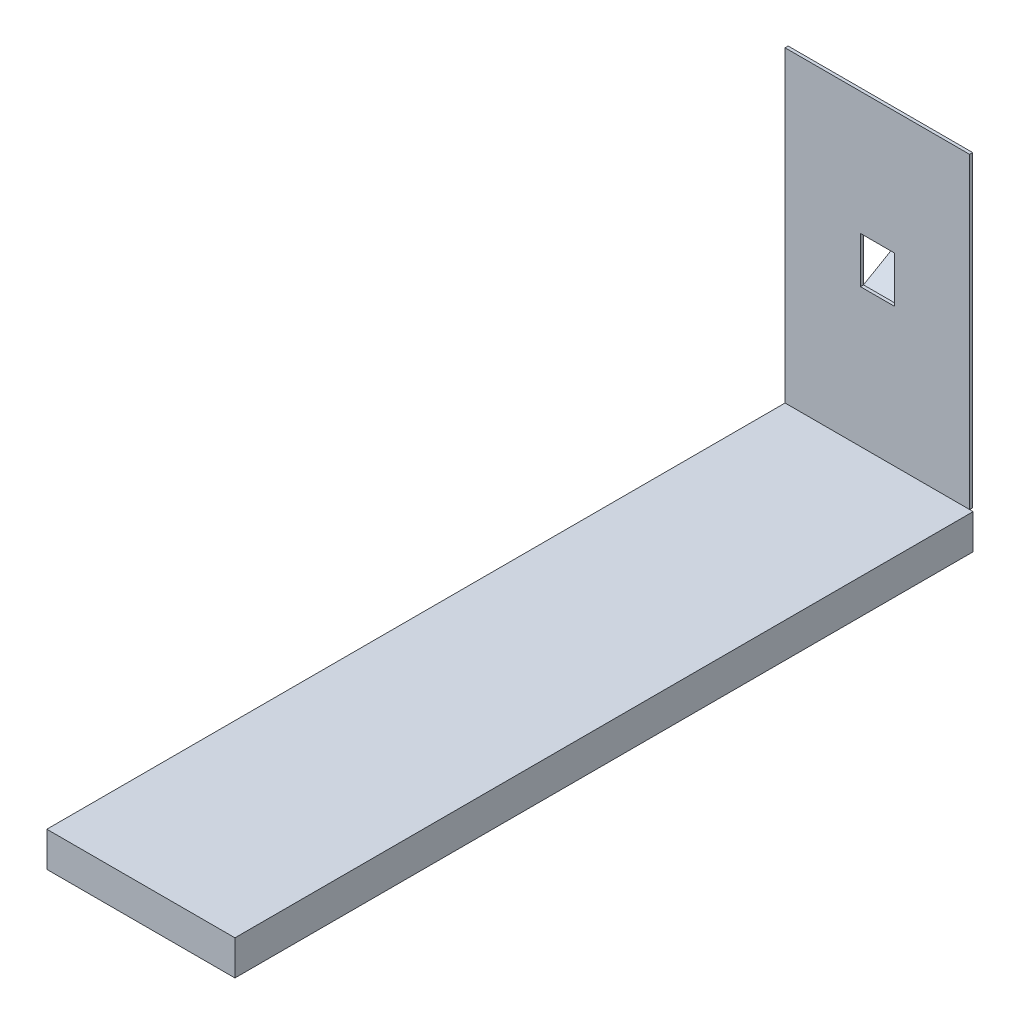
ISO-10303-21;
HEADER;
FILE_DESCRIPTION(('STEP AP214'),'2;1');
FILE_NAME('part.step','',(''),(''),'','','');
FILE_SCHEMA(('AUTOMOTIVE_DESIGN { 1 0 10303 214 1 1 1 1 }'));
ENDSEC;
DATA;
#1=APPLICATION_CONTEXT('core data for automotive mechanical design processes');
#2=APPLICATION_PROTOCOL_DEFINITION('international standard','automotive_design',2000,#1);
#3=PRODUCT_CONTEXT('',#1,'mechanical');
#4=PRODUCT('Part','Part','',(#3));
#5=PRODUCT_RELATED_PRODUCT_CATEGORY('part','',(#4));
#6=PRODUCT_DEFINITION_FORMATION('','',#4);
#7=PRODUCT_DEFINITION_CONTEXT('part definition',#1,'design');
#8=PRODUCT_DEFINITION('design','',#6,#7);
#9=PRODUCT_DEFINITION_SHAPE('','',#8);
#10=(LENGTH_UNIT() NAMED_UNIT(*) SI_UNIT(.MILLI.,.METRE.));
#11=(NAMED_UNIT(*) PLANE_ANGLE_UNIT() SI_UNIT($,.RADIAN.));
#12=(NAMED_UNIT(*) SI_UNIT($,.STERADIAN.) SOLID_ANGLE_UNIT());
#13=UNCERTAINTY_MEASURE_WITH_UNIT(LENGTH_MEASURE(1.E-05),#10,'distance_accuracy_value','');
#14=(GEOMETRIC_REPRESENTATION_CONTEXT(3) GLOBAL_UNCERTAINTY_ASSIGNED_CONTEXT((#13)) GLOBAL_UNIT_ASSIGNED_CONTEXT((#10,
#11,#12)) REPRESENTATION_CONTEXT('',''));
#15=CARTESIAN_POINT('',(0.,0.,0.));
#16=DIRECTION('',(0.,0.,1.));
#17=DIRECTION('',(1.,0.,0.));
#18=AXIS2_PLACEMENT_3D('',#15,#16,#17);
#19=CARTESIAN_POINT('',(-600.,-1000.,4819.57152918214));
#20=DIRECTION('',(1.,0.,0.));
#21=DIRECTION('',(0.,0.,-1.));
#22=AXIS2_PLACEMENT_3D('',#19,#20,#21);
#23=PLANE('',#22);
#24=DIRECTION('',(0.,-1.,0.));
#25=VECTOR('',#24,1.);
#26=CARTESIAN_POINT('',(-600.,-1000.,20.));
#27=LINE('',#26,#25);
#28=CARTESIAN_POINT('',(-600.,-1000.,20.));
#29=VERTEX_POINT('',#28);
#30=CARTESIAN_POINT('',(-600.,-1226.24036004448,20.));
#31=VERTEX_POINT('',#30);
#32=EDGE_CURVE('E108',#29,#31,#27,.T.);
#33=ORIENTED_EDGE('',*,*,#32,.T.);
#34=DIRECTION('',(0.,0.,-1.));
#35=VECTOR('',#34,1.);
#36=CARTESIAN_POINT('',(-600.,-1226.24036004448,4819.57152918214));
#37=LINE('',#36,#35);
#38=CARTESIAN_POINT('',(-600.,-1226.24036004448,4819.57152918214));
#39=VERTEX_POINT('',#38);
#40=EDGE_CURVE('E12',#39,#31,#37,.T.);
#41=ORIENTED_EDGE('',*,*,#40,.F.);
#42=DIRECTION('',(0.,-1.,0.));
#43=VECTOR('',#42,1.);
#44=CARTESIAN_POINT('',(-600.,-1000.,4819.57152918214));
#45=LINE('',#44,#43);
#46=CARTESIAN_POINT('',(-600.,-1000.,4819.57152918214));
#47=VERTEX_POINT('',#46);
#48=EDGE_CURVE('E96',#47,#39,#45,.T.);
#49=ORIENTED_EDGE('',*,*,#48,.F.);
#50=DIRECTION('',(0.,0.,-1.));
#51=VECTOR('',#50,1.);
#52=CARTESIAN_POINT('',(-600.,-1000.,4819.57152918214));
#53=LINE('',#52,#51);
#54=EDGE_CURVE('E104',#47,#29,#53,.T.);
#55=ORIENTED_EDGE('',*,*,#54,.T.);
#56=EDGE_LOOP('',(#33,#41,#49,#55));
#57=FACE_BOUND('',#56,.T.);
#58=ADVANCED_FACE('F45',(#57),#23,.F.);
#59=CARTESIAN_POINT('',(-600.,-1226.24036004448,4819.57152918214));
#60=DIRECTION('',(0.,1.,0.));
#61=DIRECTION('',(0.,0.,1.));
#62=AXIS2_PLACEMENT_3D('',#59,#60,#61);
#63=PLANE('',#62);
#64=DIRECTION('',(1.,0.,0.));
#65=VECTOR('',#64,1.);
#66=CARTESIAN_POINT('',(-600.,-1226.24036004448,20.));
#67=LINE('',#66,#65);
#68=CARTESIAN_POINT('',(623.007667220371,-1226.24036004448,20.));
#69=VERTEX_POINT('',#68);
#70=EDGE_CURVE('E100',#31,#69,#67,.T.);
#71=ORIENTED_EDGE('',*,*,#70,.T.);
#72=DIRECTION('',(0.,0.,-1.));
#73=VECTOR('',#72,1.);
#74=CARTESIAN_POINT('',(623.007667220371,-1226.24036004448,4819.57152918214));
#75=LINE('',#74,#73);
#76=CARTESIAN_POINT('',(623.007667220371,-1226.24036004448,4819.57152918214));
#77=VERTEX_POINT('',#76);
#78=EDGE_CURVE('E53',#77,#69,#75,.T.);
#79=ORIENTED_EDGE('',*,*,#78,.F.);
#80=DIRECTION('',(1.,0.,0.));
#81=VECTOR('',#80,1.);
#82=CARTESIAN_POINT('',(-600.,-1226.24036004448,4819.57152918214));
#83=LINE('',#82,#81);
#84=EDGE_CURVE('E91',#39,#77,#83,.T.);
#85=ORIENTED_EDGE('',*,*,#84,.F.);
#86=ORIENTED_EDGE('',*,*,#40,.T.);
#87=EDGE_LOOP('',(#71,#79,#85,#86));
#88=FACE_BOUND('',#87,.T.);
#89=ADVANCED_FACE('F99',(#88),#63,.F.);
#90=CARTESIAN_POINT('',(623.007667220371,-1000.,4819.57152918214));
#91=DIRECTION('',(-1.,0.,0.));
#92=DIRECTION('',(0.,0.,1.));
#93=AXIS2_PLACEMENT_3D('',#90,#91,#92);
#94=PLANE('',#93);
#95=DIRECTION('',(0.,1.,0.));
#96=VECTOR('',#95,1.);
#97=CARTESIAN_POINT('',(623.007667220371,-1000.,20.));
#98=LINE('',#97,#96);
#99=CARTESIAN_POINT('',(623.007667220371,-1000.,20.));
#100=VERTEX_POINT('',#99);
#101=EDGE_CURVE('E78',#69,#100,#98,.T.);
#102=ORIENTED_EDGE('',*,*,#101,.T.);
#103=DIRECTION('',(0.,0.,-1.));
#104=VECTOR('',#103,1.);
#105=CARTESIAN_POINT('',(623.007667220371,-1000.,4819.57152918214));
#106=LINE('',#105,#104);
#107=CARTESIAN_POINT('',(623.007667220371,-1000.,4819.57152918214));
#108=VERTEX_POINT('',#107);
#109=EDGE_CURVE('E101',#108,#100,#106,.T.);
#110=ORIENTED_EDGE('',*,*,#109,.F.);
#111=DIRECTION('',(0.,1.,0.));
#112=VECTOR('',#111,1.);
#113=CARTESIAN_POINT('',(623.007667220371,-1000.,4819.57152918214));
#114=LINE('',#113,#112);
#115=EDGE_CURVE('E94',#77,#108,#114,.T.);
#116=ORIENTED_EDGE('',*,*,#115,.F.);
#117=ORIENTED_EDGE('',*,*,#78,.T.);
#118=EDGE_LOOP('',(#102,#110,#116,#117));
#119=FACE_BOUND('',#118,.T.);
#120=ADVANCED_FACE('F102',(#119),#94,.F.);
#121=CARTESIAN_POINT('',(-600.,-1000.,4819.57152918214));
#122=DIRECTION('',(0.,-1.,0.));
#123=DIRECTION('',(0.,0.,-1.));
#124=AXIS2_PLACEMENT_3D('',#121,#122,#123);
#125=PLANE('',#124);
#126=DIRECTION('',(-1.,0.,0.));
#127=VECTOR('',#126,1.);
#128=CARTESIAN_POINT('',(-600.,-1000.,20.));
#129=LINE('',#128,#127);
#130=EDGE_CURVE('E84',#100,#29,#129,.T.);
#131=ORIENTED_EDGE('',*,*,#130,.T.);
#132=ORIENTED_EDGE('',*,*,#54,.F.);
#133=DIRECTION('',(-1.,0.,0.));
#134=VECTOR('',#133,1.);
#135=CARTESIAN_POINT('',(-600.,-1000.,4819.57152918214));
#136=LINE('',#135,#134);
#137=EDGE_CURVE('E61',#108,#47,#136,.T.);
#138=ORIENTED_EDGE('',*,*,#137,.F.);
#139=ORIENTED_EDGE('',*,*,#109,.T.);
#140=EDGE_LOOP('',(#131,#132,#138,#139));
#141=FACE_BOUND('',#140,.T.);
#142=ADVANCED_FACE('F115',(#141),#125,.F.);
#143=CARTESIAN_POINT('',(0.,0.,4819.57152918214));
#144=DIRECTION('',(0.,0.,1.));
#145=DIRECTION('',(1.,0.,0.));
#146=AXIS2_PLACEMENT_3D('',#143,#144,#145);
#147=PLANE('',#146);
#148=ORIENTED_EDGE('',*,*,#48,.T.);
#149=ORIENTED_EDGE('',*,*,#84,.T.);
#150=ORIENTED_EDGE('',*,*,#115,.T.);
#151=ORIENTED_EDGE('',*,*,#137,.T.);
#152=EDGE_LOOP('',(#148,#149,#150,#151));
#153=FACE_BOUND('',#152,.T.);
#154=ADVANCED_FACE('F92',(#153),#147,.T.);
#155=CARTESIAN_POINT('',(0.,0.,20.));
#156=DIRECTION('',(0.,0.,1.));
#157=DIRECTION('',(1.,0.,0.));
#158=AXIS2_PLACEMENT_3D('',#155,#156,#157);
#159=PLANE('',#158);
#160=ORIENTED_EDGE('',*,*,#32,.F.);
#161=ORIENTED_EDGE('',*,*,#130,.F.);
#162=ORIENTED_EDGE('',*,*,#101,.F.);
#163=ORIENTED_EDGE('',*,*,#70,.F.);
#164=EDGE_LOOP('',(#160,#161,#162,#163));
#165=FACE_BOUND('',#164,.T.);
#166=ADVANCED_FACE('F118',(#165),#159,.F.);
#167=CLOSED_SHELL('',(#58,#89,#120,#142,#154,#166));
#168=MANIFOLD_SOLID_BREP('B2',#167);
#169=CARTESIAN_POINT('',(0.,0.,0.));
#170=DIRECTION('',(0.,0.,1.));
#171=DIRECTION('',(1.,0.,0.));
#172=AXIS2_PLACEMENT_3D('',#169,#170,#171);
#173=PLANE('',#172);
#174=DIRECTION('',(0.,-1.,0.));
#175=VECTOR('',#174,1.);
#176=CARTESIAN_POINT('',(-600.,-1000.,0.));
#177=LINE('',#176,#175);
#178=CARTESIAN_POINT('',(-600.,1000.,0.));
#179=VERTEX_POINT('',#178);
#180=CARTESIAN_POINT('',(-600.,-1000.,0.));
#181=VERTEX_POINT('',#180);
#182=EDGE_CURVE('E306',#179,#181,#177,.T.);
#183=ORIENTED_EDGE('',*,*,#182,.F.);
#184=DIRECTION('',(-1.,0.,0.));
#185=VECTOR('',#184,1.);
#186=CARTESIAN_POINT('',(600.,1000.,0.));
#187=LINE('',#186,#185);
#188=CARTESIAN_POINT('',(600.,1000.,0.));
#189=VERTEX_POINT('',#188);
#190=EDGE_CURVE('E316',#189,#179,#187,.T.);
#191=ORIENTED_EDGE('',*,*,#190,.F.);
#192=DIRECTION('',(0.,1.,0.));
#193=VECTOR('',#192,1.);
#194=CARTESIAN_POINT('',(600.,-1000.,0.));
#195=LINE('',#194,#193);
#196=CARTESIAN_POINT('',(600.,-1000.,0.));
#197=VERTEX_POINT('',#196);
#198=EDGE_CURVE('E327',#197,#189,#195,.T.);
#199=ORIENTED_EDGE('',*,*,#198,.F.);
#200=DIRECTION('',(1.,0.,0.));
#201=VECTOR('',#200,1.);
#202=CARTESIAN_POINT('',(600.,-1000.,0.));
#203=LINE('',#202,#201);
#204=EDGE_CURVE('E325',#181,#197,#203,.T.);
#205=ORIENTED_EDGE('',*,*,#204,.F.);
#206=EDGE_LOOP('',(#183,#191,#199,#205));
#207=FACE_BOUND('',#206,.T.);
#208=DIRECTION('',(0.,1.,0.));
#209=VECTOR('',#208,1.);
#210=CARTESIAN_POINT('',(-110.,-111.547005383792,0.));
#211=LINE('',#210,#209);
#212=CARTESIAN_POINT('',(-110.,-111.547005383792,0.));
#213=VERTEX_POINT('',#212);
#214=CARTESIAN_POINT('',(-110.,-99.9999999999996,0.));
#215=VERTEX_POINT('',#214);
#216=EDGE_CURVE('E277',#213,#215,#211,.T.);
#217=ORIENTED_EDGE('',*,*,#216,.F.);
#218=DIRECTION('',(-1.,0.,0.));
#219=VECTOR('',#218,1.);
#220=CARTESIAN_POINT('',(110.,-111.547005383792,0.));
#221=LINE('',#220,#219);
#222=CARTESIAN_POINT('',(110.,-111.547005383792,0.));
#223=VERTEX_POINT('',#222);
#224=EDGE_CURVE('E270',#223,#213,#221,.T.);
#225=ORIENTED_EDGE('',*,*,#224,.F.);
#226=DIRECTION('',(0.,1.,0.));
#227=VECTOR('',#226,1.);
#228=CARTESIAN_POINT('',(110.,-111.547005383792,0.));
#229=LINE('',#228,#227);
#230=CARTESIAN_POINT('',(110.,-99.9999999999996,0.));
#231=VERTEX_POINT('',#230);
#232=EDGE_CURVE('E252',#223,#231,#229,.T.);
#233=ORIENTED_EDGE('',*,*,#232,.T.);
#234=DIRECTION('',(0.,1.,0.));
#235=VECTOR('',#234,1.);
#236=CARTESIAN_POINT('',(110.,-99.9999999999996,0.));
#237=LINE('',#236,#235);
#238=CARTESIAN_POINT('',(110.,200.,0.));
#239=VERTEX_POINT('',#238);
#240=EDGE_CURVE('E285',#231,#239,#237,.T.);
#241=ORIENTED_EDGE('',*,*,#240,.T.);
#242=DIRECTION('',(-1.,0.,0.));
#243=VECTOR('',#242,1.);
#244=CARTESIAN_POINT('',(-110.,200.,0.));
#245=LINE('',#244,#243);
#246=CARTESIAN_POINT('',(-110.,200.,0.));
#247=VERTEX_POINT('',#246);
#248=EDGE_CURVE('E287',#239,#247,#245,.T.);
#249=ORIENTED_EDGE('',*,*,#248,.T.);
#250=DIRECTION('',(0.,-1.,0.));
#251=VECTOR('',#250,1.);
#252=CARTESIAN_POINT('',(-110.,-99.9999999999996,0.));
#253=LINE('',#252,#251);
#254=EDGE_CURVE('E192',#247,#215,#253,.T.);
#255=ORIENTED_EDGE('',*,*,#254,.T.);
#256=EDGE_LOOP('',(#217,#225,#233,#241,#249,#255));
#257=FACE_BOUND('',#256,.T.);
#258=ADVANCED_FACE('F169',(#207,#257),#173,.F.);
#259=CARTESIAN_POINT('',(-600.,-1000.,20.));
#260=DIRECTION('',(1.,0.,0.));
#261=DIRECTION('',(0.,0.,-1.));
#262=AXIS2_PLACEMENT_3D('',#259,#260,#261);
#263=PLANE('',#262);
#264=ORIENTED_EDGE('',*,*,#182,.T.);
#265=DIRECTION('',(0.,0.,-1.));
#266=VECTOR('',#265,1.);
#267=CARTESIAN_POINT('',(-600.,-1000.,20.));
#268=LINE('',#267,#266);
#269=CARTESIAN_POINT('',(-600.,-1000.,20.));
#270=VERTEX_POINT('',#269);
#271=EDGE_CURVE('E43',#270,#181,#268,.T.);
#272=ORIENTED_EDGE('',*,*,#271,.F.);
#273=DIRECTION('',(0.,-1.,0.));
#274=VECTOR('',#273,1.);
#275=CARTESIAN_POINT('',(-600.,-1000.,20.));
#276=LINE('',#275,#274);
#277=CARTESIAN_POINT('',(-600.,1000.,20.));
#278=VERTEX_POINT('',#277);
#279=EDGE_CURVE('E312',#278,#270,#276,.T.);
#280=ORIENTED_EDGE('',*,*,#279,.F.);
#281=DIRECTION('',(0.,0.,-1.));
#282=VECTOR('',#281,1.);
#283=CARTESIAN_POINT('',(-600.,1000.,20.));
#284=LINE('',#283,#282);
#285=EDGE_CURVE('E322',#278,#179,#284,.T.);
#286=ORIENTED_EDGE('',*,*,#285,.T.);
#287=EDGE_LOOP('',(#264,#272,#280,#286));
#288=FACE_BOUND('',#287,.T.);
#289=ADVANCED_FACE('F171',(#288),#263,.F.);
#290=CARTESIAN_POINT('',(600.,-1000.,20.));
#291=DIRECTION('',(0.,1.,0.));
#292=DIRECTION('',(-1.,0.,0.));
#293=AXIS2_PLACEMENT_3D('',#290,#291,#292);
#294=PLANE('',#293);
#295=ORIENTED_EDGE('',*,*,#204,.T.);
#296=DIRECTION('',(0.,0.,-1.));
#297=VECTOR('',#296,1.);
#298=CARTESIAN_POINT('',(600.,-1000.,20.));
#299=LINE('',#298,#297);
#300=CARTESIAN_POINT('',(600.,-1000.,20.));
#301=VERTEX_POINT('',#300);
#302=EDGE_CURVE('E177',#301,#197,#299,.T.);
#303=ORIENTED_EDGE('',*,*,#302,.F.);
#304=DIRECTION('',(1.,0.,0.));
#305=VECTOR('',#304,1.);
#306=CARTESIAN_POINT('',(600.,-1000.,20.));
#307=LINE('',#306,#305);
#308=EDGE_CURVE('E315',#270,#301,#307,.T.);
#309=ORIENTED_EDGE('',*,*,#308,.F.);
#310=ORIENTED_EDGE('',*,*,#271,.T.);
#311=EDGE_LOOP('',(#295,#303,#309,#310));
#312=FACE_BOUND('',#311,.T.);
#313=ADVANCED_FACE('F354',(#312),#294,.F.);
#314=CARTESIAN_POINT('',(600.,-1000.,20.));
#315=DIRECTION('',(-1.,0.,0.));
#316=DIRECTION('',(0.,0.,1.));
#317=AXIS2_PLACEMENT_3D('',#314,#315,#316);
#318=PLANE('',#317);
#319=ORIENTED_EDGE('',*,*,#198,.T.);
#320=DIRECTION('',(0.,0.,-1.));
#321=VECTOR('',#320,1.);
#322=CARTESIAN_POINT('',(600.,1000.,20.));
#323=LINE('',#322,#321);
#324=CARTESIAN_POINT('',(600.,1000.,20.));
#325=VERTEX_POINT('',#324);
#326=EDGE_CURVE('E332',#325,#189,#323,.T.);
#327=ORIENTED_EDGE('',*,*,#326,.F.);
#328=DIRECTION('',(0.,1.,0.));
#329=VECTOR('',#328,1.);
#330=CARTESIAN_POINT('',(600.,-1000.,20.));
#331=LINE('',#330,#329);
#332=EDGE_CURVE('E318',#301,#325,#331,.T.);
#333=ORIENTED_EDGE('',*,*,#332,.F.);
#334=ORIENTED_EDGE('',*,*,#302,.T.);
#335=EDGE_LOOP('',(#319,#327,#333,#334));
#336=FACE_BOUND('',#335,.T.);
#337=ADVANCED_FACE('F339',(#336),#318,.F.);
#338=CARTESIAN_POINT('',(600.,1000.,20.));
#339=DIRECTION('',(0.,-1.,0.));
#340=DIRECTION('',(0.,0.,-1.));
#341=AXIS2_PLACEMENT_3D('',#338,#339,#340);
#342=PLANE('',#341);
#343=ORIENTED_EDGE('',*,*,#190,.T.);
#344=ORIENTED_EDGE('',*,*,#285,.F.);
#345=DIRECTION('',(-1.,0.,0.));
#346=VECTOR('',#345,1.);
#347=CARTESIAN_POINT('',(600.,1000.,20.));
#348=LINE('',#347,#346);
#349=EDGE_CURVE('E320',#325,#278,#348,.T.);
#350=ORIENTED_EDGE('',*,*,#349,.F.);
#351=ORIENTED_EDGE('',*,*,#326,.T.);
#352=EDGE_LOOP('',(#343,#344,#350,#351));
#353=FACE_BOUND('',#352,.T.);
#354=ADVANCED_FACE('F347',(#353),#342,.F.);
#355=CARTESIAN_POINT('',(0.,0.,20.));
#356=DIRECTION('',(0.,0.,1.));
#357=DIRECTION('',(1.,0.,0.));
#358=AXIS2_PLACEMENT_3D('',#355,#356,#357);
#359=PLANE('',#358);
#360=DIRECTION('',(0.,1.,0.));
#361=VECTOR('',#360,1.);
#362=CARTESIAN_POINT('',(110.,-99.9999999999996,20.));
#363=LINE('',#362,#361);
#364=CARTESIAN_POINT('',(110.,-99.9999999999996,20.));
#365=VERTEX_POINT('',#364);
#366=CARTESIAN_POINT('',(110.,200.,20.));
#367=VERTEX_POINT('',#366);
#368=EDGE_CURVE('E184',#365,#367,#363,.T.);
#369=ORIENTED_EDGE('',*,*,#368,.F.);
#370=DIRECTION('',(1.,0.,0.));
#371=VECTOR('',#370,1.);
#372=CARTESIAN_POINT('',(-110.,-99.9999999999996,20.));
#373=LINE('',#372,#371);
#374=CARTESIAN_POINT('',(-110.,-99.9999999999996,20.));
#375=VERTEX_POINT('',#374);
#376=EDGE_CURVE('E288',#375,#365,#373,.T.);
#377=ORIENTED_EDGE('',*,*,#376,.F.);
#378=DIRECTION('',(0.,-1.,0.));
#379=VECTOR('',#378,1.);
#380=CARTESIAN_POINT('',(-110.,-99.9999999999996,20.));
#381=LINE('',#380,#379);
#382=CARTESIAN_POINT('',(-110.,200.,20.));
#383=VERTEX_POINT('',#382);
#384=EDGE_CURVE('E299',#383,#375,#381,.T.);
#385=ORIENTED_EDGE('',*,*,#384,.F.);
#386=DIRECTION('',(-1.,0.,0.));
#387=VECTOR('',#386,1.);
#388=CARTESIAN_POINT('',(-110.,200.,20.));
#389=LINE('',#388,#387);
#390=EDGE_CURVE('E296',#367,#383,#389,.T.);
#391=ORIENTED_EDGE('',*,*,#390,.F.);
#392=EDGE_LOOP('',(#369,#377,#385,#391));
#393=FACE_BOUND('',#392,.T.);
#394=ORIENTED_EDGE('',*,*,#279,.T.);
#395=ORIENTED_EDGE('',*,*,#308,.T.);
#396=ORIENTED_EDGE('',*,*,#332,.T.);
#397=ORIENTED_EDGE('',*,*,#349,.T.);
#398=EDGE_LOOP('',(#394,#395,#396,#397));
#399=FACE_BOUND('',#398,.T.);
#400=ADVANCED_FACE('F353',(#393,#399),#359,.T.);
#401=CARTESIAN_POINT('',(110.,-99.9999999999996,0.));
#402=DIRECTION('',(1.,0.,0.));
#403=DIRECTION('',(0.,0.,-1.));
#404=AXIS2_PLACEMENT_3D('',#401,#402,#403);
#405=PLANE('',#404);
#406=ORIENTED_EDGE('',*,*,#368,.T.);
#407=DIRECTION('',(0.,0.,1.));
#408=VECTOR('',#407,1.);
#409=CARTESIAN_POINT('',(110.,200.,0.));
#410=LINE('',#409,#408);
#411=EDGE_CURVE('E294',#239,#367,#410,.T.);
#412=ORIENTED_EDGE('',*,*,#411,.F.);
#413=ORIENTED_EDGE('',*,*,#240,.F.);
#414=DIRECTION('',(0.,0.,1.));
#415=VECTOR('',#414,1.);
#416=CARTESIAN_POINT('',(110.,-99.9999999999996,0.));
#417=LINE('',#416,#415);
#418=EDGE_CURVE('E304',#231,#365,#417,.T.);
#419=ORIENTED_EDGE('',*,*,#418,.T.);
#420=EDGE_LOOP('',(#406,#412,#413,#419));
#421=FACE_BOUND('',#420,.T.);
#422=ADVANCED_FACE('F372',(#421),#405,.F.);
#423=CARTESIAN_POINT('',(-110.,-99.9999999999996,0.));
#424=DIRECTION('',(0.,-1.,0.));
#425=DIRECTION('',(0.,0.,-1.));
#426=AXIS2_PLACEMENT_3D('',#423,#424,#425);
#427=PLANE('',#426);
#428=ORIENTED_EDGE('',*,*,#376,.T.);
#429=ORIENTED_EDGE('',*,*,#418,.F.);
#430=DIRECTION('',(1.,0.,0.));
#431=VECTOR('',#430,1.);
#432=CARTESIAN_POINT('',(-110.,-99.9999999999996,0.));
#433=LINE('',#432,#431);
#434=EDGE_CURVE('E292',#215,#231,#433,.T.);
#435=ORIENTED_EDGE('',*,*,#434,.F.);
#436=DIRECTION('',(0.,0.,1.));
#437=VECTOR('',#436,1.);
#438=CARTESIAN_POINT('',(-110.,-99.9999999999996,0.));
#439=LINE('',#438,#437);
#440=EDGE_CURVE('E307',#215,#375,#439,.T.);
#441=ORIENTED_EDGE('',*,*,#440,.T.);
#442=EDGE_LOOP('',(#428,#429,#435,#441));
#443=FACE_BOUND('',#442,.T.);
#444=ADVANCED_FACE('F377',(#443),#427,.F.);
#445=CARTESIAN_POINT('',(-110.,-99.9999999999996,0.));
#446=DIRECTION('',(-1.,0.,0.));
#447=DIRECTION('',(0.,0.,1.));
#448=AXIS2_PLACEMENT_3D('',#445,#446,#447);
#449=PLANE('',#448);
#450=ORIENTED_EDGE('',*,*,#384,.T.);
#451=ORIENTED_EDGE('',*,*,#440,.F.);
#452=ORIENTED_EDGE('',*,*,#254,.F.);
#453=DIRECTION('',(0.,0.,1.));
#454=VECTOR('',#453,1.);
#455=CARTESIAN_POINT('',(-110.,200.,0.));
#456=LINE('',#455,#454);
#457=EDGE_CURVE('E309',#247,#383,#456,.T.);
#458=ORIENTED_EDGE('',*,*,#457,.T.);
#459=EDGE_LOOP('',(#450,#451,#452,#458));
#460=FACE_BOUND('',#459,.T.);
#461=ADVANCED_FACE('F387',(#460),#449,.F.);
#462=CARTESIAN_POINT('',(-110.,200.,0.));
#463=DIRECTION('',(0.,1.,0.));
#464=DIRECTION('',(0.,0.,1.));
#465=AXIS2_PLACEMENT_3D('',#462,#463,#464);
#466=PLANE('',#465);
#467=ORIENTED_EDGE('',*,*,#390,.T.);
#468=ORIENTED_EDGE('',*,*,#457,.F.);
#469=ORIENTED_EDGE('',*,*,#248,.F.);
#470=ORIENTED_EDGE('',*,*,#411,.T.);
#471=EDGE_LOOP('',(#467,#468,#469,#470));
#472=FACE_BOUND('',#471,.T.);
#473=ADVANCED_FACE('F382',(#472),#466,.F.);
#474=CARTESIAN_POINT('',(110.,-108.660254037844,-4.99999999999998));
#475=DIRECTION('',(0.,0.86602540378444,0.499999999999998));
#476=DIRECTION('',(0.,-0.499999999999998,0.86602540378444));
#477=AXIS2_PLACEMENT_3D('',#474,#475,#476);
#478=PLANE('',#477);
#479=DIRECTION('',(0.,0.499999999999998,-0.86602540378444));
#480=VECTOR('',#479,1.);
#481=CARTESIAN_POINT('',(-110.,-108.660254037844,-4.99999999999998));
#482=LINE('',#481,#480);
#483=CARTESIAN_POINT('',(-110.,35.099962990372,-254.));
#484=VERTEX_POINT('',#483);
#485=EDGE_CURVE('E274',#213,#484,#482,.T.);
#486=ORIENTED_EDGE('',*,*,#485,.T.);
#487=DIRECTION('',(-1.,0.,0.));
#488=VECTOR('',#487,1.);
#489=CARTESIAN_POINT('',(110.,35.099962990372,-254.));
#490=LINE('',#489,#488);
#491=CARTESIAN_POINT('',(110.,35.099962990372,-254.));
#492=VERTEX_POINT('',#491);
#493=EDGE_CURVE('E272',#492,#484,#490,.T.);
#494=ORIENTED_EDGE('',*,*,#493,.F.);
#495=DIRECTION('',(0.,-0.499999999999998,0.86602540378444));
#496=VECTOR('',#495,1.);
#497=CARTESIAN_POINT('',(110.,-108.660254037844,-4.99999999999998));
#498=LINE('',#497,#496);
#499=EDGE_CURVE('E256',#492,#223,#498,.T.);
#500=ORIENTED_EDGE('',*,*,#499,.T.);
#501=ORIENTED_EDGE('',*,*,#224,.T.);
#502=EDGE_LOOP('',(#486,#494,#500,#501));
#503=FACE_BOUND('',#502,.T.);
#504=ADVANCED_FACE('F269',(#503),#478,.F.);
#505=CARTESIAN_POINT('',(110.,46.6469683741645,-254.));
#506=DIRECTION('',(0.,0.,-1.));
#507=DIRECTION('',(0.,1.,0.));
#508=AXIS2_PLACEMENT_3D('',#505,#506,#507);
#509=PLANE('',#508);
#510=DIRECTION('',(0.,-1.,0.));
#511=VECTOR('',#510,1.);
#512=CARTESIAN_POINT('',(-110.,46.6469683741645,-254.));
#513=LINE('',#512,#511);
#514=CARTESIAN_POINT('',(-110.,46.6469683741645,-254.));
#515=VERTEX_POINT('',#514);
#516=EDGE_CURVE('E498',#515,#484,#513,.T.);
#517=ORIENTED_EDGE('',*,*,#516,.F.);
#518=DIRECTION('',(-1.,0.,0.));
#519=VECTOR('',#518,1.);
#520=CARTESIAN_POINT('',(110.,46.6469683741645,-254.));
#521=LINE('',#520,#519);
#522=CARTESIAN_POINT('',(110.,46.6469683741645,-254.));
#523=VERTEX_POINT('',#522);
#524=EDGE_CURVE('E278',#523,#515,#521,.T.);
#525=ORIENTED_EDGE('',*,*,#524,.F.);
#526=DIRECTION('',(0.,-1.,0.));
#527=VECTOR('',#526,1.);
#528=CARTESIAN_POINT('',(110.,46.6469683741645,-254.));
#529=LINE('',#528,#527);
#530=EDGE_CURVE('E279',#523,#492,#529,.T.);
#531=ORIENTED_EDGE('',*,*,#530,.T.);
#532=ORIENTED_EDGE('',*,*,#493,.T.);
#533=EDGE_LOOP('',(#517,#525,#531,#532));
#534=FACE_BOUND('',#533,.T.);
#535=ADVANCED_FACE('F400',(#534),#509,.T.);
#536=CARTESIAN_POINT('',(110.,-99.9999999999996,0.));
#537=DIRECTION('',(0.,0.86602540378444,0.499999999999998));
#538=DIRECTION('',(0.,-0.499999999999998,0.86602540378444));
#539=AXIS2_PLACEMENT_3D('',#536,#537,#538);
#540=PLANE('',#539);
#541=DIRECTION('',(0.,0.499999999999998,-0.86602540378444));
#542=VECTOR('',#541,1.);
#543=CARTESIAN_POINT('',(-110.,-99.9999999999996,0.));
#544=LINE('',#543,#542);
#545=EDGE_CURVE('E500',#215,#515,#544,.T.);
#546=ORIENTED_EDGE('',*,*,#545,.F.);
#547=ORIENTED_EDGE('',*,*,#434,.T.);
#548=DIRECTION('',(0.,0.499999999999998,-0.86602540378444));
#549=VECTOR('',#548,1.);
#550=CARTESIAN_POINT('',(110.,-99.9999999999996,0.));
#551=LINE('',#550,#549);
#552=EDGE_CURVE('E259',#231,#523,#551,.T.);
#553=ORIENTED_EDGE('',*,*,#552,.T.);
#554=ORIENTED_EDGE('',*,*,#524,.T.);
#555=EDGE_LOOP('',(#546,#547,#553,#554));
#556=FACE_BOUND('',#555,.T.);
#557=ADVANCED_FACE('F397',(#556),#540,.T.);
#558=CARTESIAN_POINT('',(110.,0.,0.));
#559=DIRECTION('',(-1.,0.,0.));
#560=DIRECTION('',(0.,0.,1.));
#561=AXIS2_PLACEMENT_3D('',#558,#559,#560);
#562=PLANE('',#561);
#563=ORIENTED_EDGE('',*,*,#499,.F.);
#564=ORIENTED_EDGE('',*,*,#530,.F.);
#565=ORIENTED_EDGE('',*,*,#552,.F.);
#566=ORIENTED_EDGE('',*,*,#232,.F.);
#567=EDGE_LOOP('',(#563,#564,#565,#566));
#568=FACE_BOUND('',#567,.T.);
#569=ADVANCED_FACE('F254',(#568),#562,.F.);
#570=CARTESIAN_POINT('',(-110.,0.,0.));
#571=DIRECTION('',(-1.,0.,0.));
#572=DIRECTION('',(0.,0.,1.));
#573=AXIS2_PLACEMENT_3D('',#570,#571,#572);
#574=PLANE('',#573);
#575=ORIENTED_EDGE('',*,*,#485,.F.);
#576=ORIENTED_EDGE('',*,*,#216,.T.);
#577=ORIENTED_EDGE('',*,*,#545,.T.);
#578=ORIENTED_EDGE('',*,*,#516,.T.);
#579=EDGE_LOOP('',(#575,#576,#577,#578));
#580=FACE_BOUND('',#579,.T.);
#581=ADVANCED_FACE('F407',(#580),#574,.T.);
#582=CLOSED_SHELL('',(#258,#289,#313,#337,#354,#400,#422,#444,#461,#473,#504,#535,#557,#569,#581));
#583=MANIFOLD_SOLID_BREP('B6',#582);
#584=ADVANCED_BREP_SHAPE_REPRESENTATION('',(#18,#168,#583),#14);
#585=SHAPE_DEFINITION_REPRESENTATION(#9,#584);
ENDSEC;
END-ISO-10303-21;
